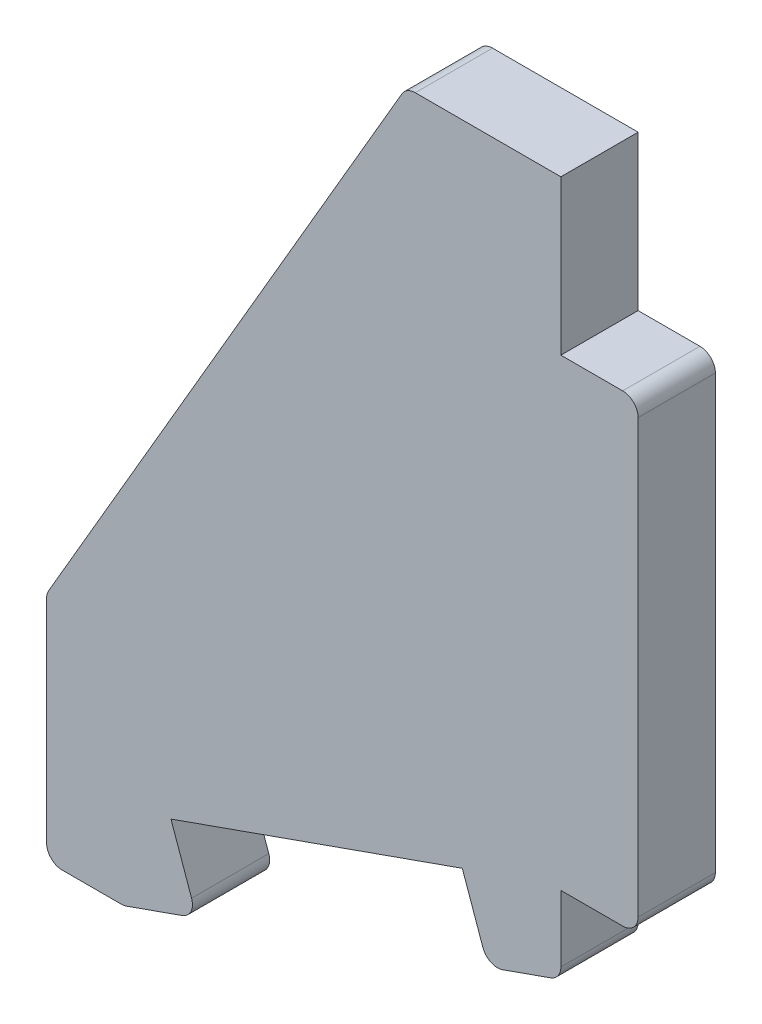
ISO-10303-21;
HEADER;
FILE_DESCRIPTION(('STEP AP214'),'2;1');
FILE_NAME('part.step','',(''),(''),'','','');
FILE_SCHEMA(('AUTOMOTIVE_DESIGN { 1 0 10303 214 1 1 1 1 }'));
ENDSEC;
DATA;
#1=APPLICATION_CONTEXT('core data for automotive mechanical design processes');
#2=APPLICATION_PROTOCOL_DEFINITION('international standard','automotive_design',2000,#1);
#3=PRODUCT_CONTEXT('',#1,'mechanical');
#4=PRODUCT('Part','Part','',(#3));
#5=PRODUCT_RELATED_PRODUCT_CATEGORY('part','',(#4));
#6=PRODUCT_DEFINITION_FORMATION('','',#4);
#7=PRODUCT_DEFINITION_CONTEXT('part definition',#1,'design');
#8=PRODUCT_DEFINITION('design','',#6,#7);
#9=PRODUCT_DEFINITION_SHAPE('','',#8);
#10=(LENGTH_UNIT() NAMED_UNIT(*) SI_UNIT(.MILLI.,.METRE.));
#11=(NAMED_UNIT(*) PLANE_ANGLE_UNIT() SI_UNIT($,.RADIAN.));
#12=(NAMED_UNIT(*) SI_UNIT($,.STERADIAN.) SOLID_ANGLE_UNIT());
#13=UNCERTAINTY_MEASURE_WITH_UNIT(LENGTH_MEASURE(1.E-05),#10,'distance_accuracy_value','');
#14=(GEOMETRIC_REPRESENTATION_CONTEXT(3) GLOBAL_UNCERTAINTY_ASSIGNED_CONTEXT((#13)) GLOBAL_UNIT_ASSIGNED_CONTEXT((#10,
#11,#12)) REPRESENTATION_CONTEXT('',''));
#15=CARTESIAN_POINT('',(0.,0.,0.));
#16=DIRECTION('',(0.,0.,1.));
#17=DIRECTION('',(1.,0.,0.));
#18=AXIS2_PLACEMENT_3D('',#15,#16,#17);
#19=CARTESIAN_POINT('',(0.,0.,5.));
#20=DIRECTION('',(-0.333333333333333,0.942809041582063,0.));
#21=DIRECTION('',(-0.942809041582063,-0.333333333333333,0.));
#22=AXIS2_PLACEMENT_3D('',#19,#20,#21);
#23=PLANE('',#22);
#24=DIRECTION('',(0.942809041582063,0.333333333333333,0.));
#25=VECTOR('',#24,1.);
#26=CARTESIAN_POINT('',(0.,0.,0.));
#27=LINE('',#26,#25);
#28=CARTESIAN_POINT('',(0.161760458079523,0.0571909584179365,0.));
#29=VERTEX_POINT('',#28);
#30=CARTESIAN_POINT('',(3.77123616632825,1.33333333333333,0.));
#31=VERTEX_POINT('',#30);
#32=EDGE_CURVE('E249',#29,#31,#27,.T.);
#33=ORIENTED_EDGE('',*,*,#32,.T.);
#34=DIRECTION('',(0.,0.,-1.));
#35=VECTOR('',#34,1.);
#36=CARTESIAN_POINT('',(3.77123616632825,1.33333333333333,5.));
#37=LINE('',#36,#35);
#38=CARTESIAN_POINT('',(3.77123616632825,1.33333333333333,5.));
#39=VERTEX_POINT('',#38);
#40=EDGE_CURVE('E351',#31,#39,#37,.F.);
#41=ORIENTED_EDGE('',*,*,#40,.T.);
#42=DIRECTION('',(0.942809041582063,0.333333333333333,0.));
#43=VECTOR('',#42,1.);
#44=CARTESIAN_POINT('',(0.,0.,5.));
#45=LINE('',#44,#43);
#46=CARTESIAN_POINT('',(0.161760458079523,0.0571909584179365,5.));
#47=VERTEX_POINT('',#46);
#48=EDGE_CURVE('E204',#47,#39,#45,.T.);
#49=ORIENTED_EDGE('',*,*,#48,.F.);
#50=DIRECTION('',(0.,0.,-1.));
#51=VECTOR('',#50,1.);
#52=CARTESIAN_POINT('',(0.161760458079523,0.0571909584179365,5.));
#53=LINE('',#52,#51);
#54=EDGE_CURVE('E348',#47,#29,#53,.T.);
#55=ORIENTED_EDGE('',*,*,#54,.T.);
#56=EDGE_LOOP('',(#33,#41,#49,#55));
#57=FACE_BOUND('',#56,.T.);
#58=ADVANCED_FACE('F36',(#57),#23,.F.);
#59=CARTESIAN_POINT('',(4.71404520791032,1.66666666666667,5.));
#60=DIRECTION('',(-0.942809041582063,-0.333333333333333,0.));
#61=DIRECTION('',(0.333333333333333,-0.942809041582063,0.));
#62=AXIS2_PLACEMENT_3D('',#59,#60,#61);
#63=PLANE('',#62);
#64=DIRECTION('',(-0.333333333333333,0.942809041582063,0.));
#65=VECTOR('',#64,1.);
#66=CARTESIAN_POINT('',(4.71404520791032,1.66666666666667,5.));
#67=LINE('',#66,#65);
#68=CARTESIAN_POINT('',(4.38071187457698,2.60947570824873,5.));
#69=VERTEX_POINT('',#68);
#70=CARTESIAN_POINT('',(3.04737854124365,6.38071187457699,5.));
#71=VERTEX_POINT('',#70);
#72=EDGE_CURVE('E190',#69,#71,#67,.T.);
#73=ORIENTED_EDGE('',*,*,#72,.F.);
#74=DIRECTION('',(0.,0.,-1.));
#75=VECTOR('',#74,1.);
#76=CARTESIAN_POINT('',(4.38071187457698,2.60947570824873,5.));
#77=LINE('',#76,#75);
#78=CARTESIAN_POINT('',(4.38071187457698,2.60947570824873,0.));
#79=VERTEX_POINT('',#78);
#80=EDGE_CURVE('E346',#69,#79,#77,.T.);
#81=ORIENTED_EDGE('',*,*,#80,.T.);
#82=DIRECTION('',(-0.333333333333333,0.942809041582063,0.));
#83=VECTOR('',#82,1.);
#84=CARTESIAN_POINT('',(4.71404520791032,1.66666666666667,0.));
#85=LINE('',#84,#83);
#86=CARTESIAN_POINT('',(3.04737854124365,6.38071187457699,0.));
#87=VERTEX_POINT('',#86);
#88=EDGE_CURVE('E210',#79,#87,#85,.T.);
#89=ORIENTED_EDGE('',*,*,#88,.T.);
#90=DIRECTION('',(0.,0.,-1.));
#91=VECTOR('',#90,1.);
#92=CARTESIAN_POINT('',(3.04737854124365,6.38071187457699,5.));
#93=LINE('',#92,#91);
#94=EDGE_CURVE('E207',#71,#87,#93,.T.);
#95=ORIENTED_EDGE('',*,*,#94,.F.);
#96=EDGE_LOOP('',(#73,#81,#89,#95));
#97=FACE_BOUND('',#96,.T.);
#98=ADVANCED_FACE('F208',(#97),#63,.F.);
#99=CARTESIAN_POINT('',(21.9035593728849,13.0473785412437,5.));
#100=DIRECTION('',(-0.333333333333333,0.942809041582063,0.));
#101=DIRECTION('',(-0.942809041582063,-0.333333333333333,0.));
#102=AXIS2_PLACEMENT_3D('',#99,#100,#101);
#103=PLANE('',#102);
#104=DIRECTION('',(0.942809041582063,0.333333333333333,0.));
#105=VECTOR('',#104,1.);
#106=CARTESIAN_POINT('',(21.9035593728849,13.0473785412437,0.));
#107=LINE('',#106,#105);
#108=CARTESIAN_POINT('',(21.9035593728849,13.0473785412437,0.));
#109=VERTEX_POINT('',#108);
#110=EDGE_CURVE('E253',#87,#109,#107,.T.);
#111=ORIENTED_EDGE('',*,*,#110,.T.);
#112=DIRECTION('',(0.,0.,-1.));
#113=VECTOR('',#112,1.);
#114=CARTESIAN_POINT('',(21.9035593728849,13.0473785412437,5.));
#115=LINE('',#114,#113);
#116=CARTESIAN_POINT('',(21.9035593728849,13.0473785412437,5.));
#117=VERTEX_POINT('',#116);
#118=EDGE_CURVE('E214',#117,#109,#115,.T.);
#119=ORIENTED_EDGE('',*,*,#118,.F.);
#120=DIRECTION('',(0.942809041582063,0.333333333333333,0.));
#121=VECTOR('',#120,1.);
#122=CARTESIAN_POINT('',(21.9035593728849,13.0473785412437,5.));
#123=LINE('',#122,#121);
#124=EDGE_CURVE('E196',#71,#117,#123,.T.);
#125=ORIENTED_EDGE('',*,*,#124,.F.);
#126=ORIENTED_EDGE('',*,*,#94,.T.);
#127=EDGE_LOOP('',(#111,#119,#125,#126));
#128=FACE_BOUND('',#127,.T.);
#129=ADVANCED_FACE('F216',(#128),#103,.F.);
#130=CARTESIAN_POINT('',(23.5702260395516,8.33333333333334,5.));
#131=DIRECTION('',(0.942809041582063,0.333333333333334,0.));
#132=DIRECTION('',(-0.333333333333334,0.942809041582063,0.));
#133=AXIS2_PLACEMENT_3D('',#130,#131,#132);
#134=PLANE('',#133);
#135=DIRECTION('',(0.333333333333334,-0.942809041582063,0.));
#136=VECTOR('',#135,1.);
#137=CARTESIAN_POINT('',(23.5702260395516,8.33333333333334,0.));
#138=LINE('',#137,#136);
#139=CARTESIAN_POINT('',(23.2368927062183,9.2761423749154,0.));
#140=VERTEX_POINT('',#139);
#141=EDGE_CURVE('E255',#109,#140,#138,.T.);
#142=ORIENTED_EDGE('',*,*,#141,.T.);
#143=DIRECTION('',(0.,0.,-1.));
#144=VECTOR('',#143,1.);
#145=CARTESIAN_POINT('',(23.2368927062183,9.2761423749154,5.));
#146=LINE('',#145,#144);
#147=CARTESIAN_POINT('',(23.2368927062183,9.2761423749154,5.));
#148=VERTEX_POINT('',#147);
#149=EDGE_CURVE('E344',#140,#148,#146,.F.);
#150=ORIENTED_EDGE('',*,*,#149,.T.);
#151=DIRECTION('',(0.333333333333334,-0.942809041582063,0.));
#152=VECTOR('',#151,1.);
#153=CARTESIAN_POINT('',(23.5702260395516,8.33333333333334,5.));
#154=LINE('',#153,#152);
#155=EDGE_CURVE('E219',#117,#148,#154,.T.);
#156=ORIENTED_EDGE('',*,*,#155,.F.);
#157=ORIENTED_EDGE('',*,*,#118,.T.);
#158=EDGE_LOOP('',(#142,#150,#156,#157));
#159=FACE_BOUND('',#158,.T.);
#160=ADVANCED_FACE('F599',(#159),#134,.F.);
#161=CARTESIAN_POINT('',(28.2842712474619,10.,5.));
#162=DIRECTION('',(-0.333333333333333,0.942809041582064,0.));
#163=DIRECTION('',(-0.942809041582064,-0.333333333333333,0.));
#164=AXIS2_PLACEMENT_3D('',#161,#162,#163);
#165=PLANE('',#164);
#166=DIRECTION('',(0.942809041582064,0.333333333333333,0.));
#167=VECTOR('',#166,1.);
#168=CARTESIAN_POINT('',(28.2842712474619,10.,0.));
#169=LINE('',#168,#167);
#170=CARTESIAN_POINT('',(24.5130350811337,8.66666666666667,0.));
#171=VERTEX_POINT('',#170);
#172=CARTESIAN_POINT('',(27.6176045807952,9.76429773960449,0.));
#173=VERTEX_POINT('',#172);
#174=EDGE_CURVE('E258',#171,#173,#169,.T.);
#175=ORIENTED_EDGE('',*,*,#174,.T.);
#176=DIRECTION('',(0.,0.,-1.));
#177=VECTOR('',#176,1.);
#178=CARTESIAN_POINT('',(27.6176045807952,9.76429773960449,5.));
#179=LINE('',#178,#177);
#180=CARTESIAN_POINT('',(27.6176045807952,9.76429773960449,5.));
#181=VERTEX_POINT('',#180);
#182=EDGE_CURVE('E342',#173,#181,#179,.F.);
#183=ORIENTED_EDGE('',*,*,#182,.T.);
#184=DIRECTION('',(0.942809041582064,0.333333333333333,0.));
#185=VECTOR('',#184,1.);
#186=CARTESIAN_POINT('',(28.2842712474619,10.,5.));
#187=LINE('',#186,#185);
#188=CARTESIAN_POINT('',(24.5130350811337,8.66666666666667,5.));
#189=VERTEX_POINT('',#188);
#190=EDGE_CURVE('E221',#189,#181,#187,.T.);
#191=ORIENTED_EDGE('',*,*,#190,.F.);
#192=DIRECTION('',(0.,0.,-1.));
#193=VECTOR('',#192,1.);
#194=CARTESIAN_POINT('',(24.5130350811337,8.66666666666667,5.));
#195=LINE('',#194,#193);
#196=EDGE_CURVE('E339',#189,#171,#195,.T.);
#197=ORIENTED_EDGE('',*,*,#196,.T.);
#198=EDGE_LOOP('',(#175,#183,#191,#197));
#199=FACE_BOUND('',#198,.T.);
#200=ADVANCED_FACE('F590',(#199),#165,.F.);
#201=CARTESIAN_POINT('',(28.2842712474619,10.,5.));
#202=DIRECTION('',(-1.,0.,0.));
#203=DIRECTION('',(0.,-1.,0.));
#204=AXIS2_PLACEMENT_3D('',#201,#202,#203);
#205=PLANE('',#204);
#206=DIRECTION('',(0.,1.,0.));
#207=VECTOR('',#206,1.);
#208=CARTESIAN_POINT('',(28.2842712474619,10.,5.));
#209=LINE('',#208,#207);
#210=CARTESIAN_POINT('',(28.2842712474619,10.7071067811866,5.));
#211=VERTEX_POINT('',#210);
#212=CARTESIAN_POINT('',(28.2842712474619,15.,5.));
#213=VERTEX_POINT('',#212);
#214=EDGE_CURVE('E227',#211,#213,#209,.T.);
#215=ORIENTED_EDGE('',*,*,#214,.F.);
#216=DIRECTION('',(0.,0.,-1.));
#217=VECTOR('',#216,1.);
#218=CARTESIAN_POINT('',(28.2842712474619,10.7071067811866,5.));
#219=LINE('',#218,#217);
#220=CARTESIAN_POINT('',(28.2842712474619,10.7071067811866,0.));
#221=VERTEX_POINT('',#220);
#222=EDGE_CURVE('E336',#211,#221,#219,.T.);
#223=ORIENTED_EDGE('',*,*,#222,.T.);
#224=DIRECTION('',(0.,1.,0.));
#225=VECTOR('',#224,1.);
#226=CARTESIAN_POINT('',(28.2842712474619,10.,0.));
#227=LINE('',#226,#225);
#228=CARTESIAN_POINT('',(28.2842712474619,15.,0.));
#229=VERTEX_POINT('',#228);
#230=EDGE_CURVE('E261',#221,#229,#227,.T.);
#231=ORIENTED_EDGE('',*,*,#230,.T.);
#232=DIRECTION('',(0.,0.,-1.));
#233=VECTOR('',#232,1.);
#234=CARTESIAN_POINT('',(28.2842712474619,15.,5.));
#235=LINE('',#234,#233);
#236=EDGE_CURVE('E289',#213,#229,#235,.T.);
#237=ORIENTED_EDGE('',*,*,#236,.F.);
#238=EDGE_LOOP('',(#215,#223,#231,#237));
#239=FACE_BOUND('',#238,.T.);
#240=ADVANCED_FACE('F436',(#239),#205,.F.);
#241=CARTESIAN_POINT('',(28.2842712474619,15.,5.));
#242=DIRECTION('',(0.,1.,0.));
#243=DIRECTION('',(-1.,0.,0.));
#244=AXIS2_PLACEMENT_3D('',#241,#242,#243);
#245=PLANE('',#244);
#246=DIRECTION('',(1.,0.,0.));
#247=VECTOR('',#246,1.);
#248=CARTESIAN_POINT('',(28.2842712474619,15.,0.));
#249=LINE('',#248,#247);
#250=CARTESIAN_POINT('',(32.2842712474619,15.,0.));
#251=VERTEX_POINT('',#250);
#252=EDGE_CURVE('E263',#229,#251,#249,.T.);
#253=ORIENTED_EDGE('',*,*,#252,.T.);
#254=DIRECTION('',(0.,0.,-1.));
#255=VECTOR('',#254,1.);
#256=CARTESIAN_POINT('',(32.2842712474619,15.,5.));
#257=LINE('',#256,#255);
#258=CARTESIAN_POINT('',(32.2842712474619,15.,5.));
#259=VERTEX_POINT('',#258);
#260=EDGE_CURVE('E334',#251,#259,#257,.F.);
#261=ORIENTED_EDGE('',*,*,#260,.T.);
#262=DIRECTION('',(1.,0.,0.));
#263=VECTOR('',#262,1.);
#264=CARTESIAN_POINT('',(28.2842712474619,15.,5.));
#265=LINE('',#264,#263);
#266=EDGE_CURVE('E229',#213,#259,#265,.T.);
#267=ORIENTED_EDGE('',*,*,#266,.F.);
#268=ORIENTED_EDGE('',*,*,#236,.T.);
#269=EDGE_LOOP('',(#253,#261,#267,#268));
#270=FACE_BOUND('',#269,.T.);
#271=ADVANCED_FACE('F441',(#270),#245,.F.);
#272=CARTESIAN_POINT('',(33.2842712474619,15.,5.));
#273=DIRECTION('',(-1.,0.,0.));
#274=DIRECTION('',(0.,0.,1.));
#275=AXIS2_PLACEMENT_3D('',#272,#273,#274);
#276=PLANE('',#275);
#277=DIRECTION('',(0.,1.,0.));
#278=VECTOR('',#277,1.);
#279=CARTESIAN_POINT('',(33.2842712474619,15.,0.));
#280=LINE('',#279,#278);
#281=CARTESIAN_POINT('',(33.2842712474619,16.,0.));
#282=VERTEX_POINT('',#281);
#283=CARTESIAN_POINT('',(33.2842712474619,44.,0.));
#284=VERTEX_POINT('',#283);
#285=EDGE_CURVE('E266',#282,#284,#280,.T.);
#286=ORIENTED_EDGE('',*,*,#285,.T.);
#287=DIRECTION('',(0.,0.,-1.));
#288=VECTOR('',#287,1.);
#289=CARTESIAN_POINT('',(33.2842712474619,44.,5.));
#290=LINE('',#289,#288);
#291=CARTESIAN_POINT('',(33.2842712474619,44.,5.));
#292=VERTEX_POINT('',#291);
#293=EDGE_CURVE('E316',#284,#292,#290,.F.);
#294=ORIENTED_EDGE('',*,*,#293,.T.);
#295=DIRECTION('',(0.,1.,0.));
#296=VECTOR('',#295,1.);
#297=CARTESIAN_POINT('',(33.2842712474619,15.,5.));
#298=LINE('',#297,#296);
#299=CARTESIAN_POINT('',(33.2842712474619,16.,5.));
#300=VERTEX_POINT('',#299);
#301=EDGE_CURVE('E232',#300,#292,#298,.T.);
#302=ORIENTED_EDGE('',*,*,#301,.F.);
#303=DIRECTION('',(0.,0.,-1.));
#304=VECTOR('',#303,1.);
#305=CARTESIAN_POINT('',(33.2842712474619,16.,5.));
#306=LINE('',#305,#304);
#307=EDGE_CURVE('E313',#300,#282,#306,.T.);
#308=ORIENTED_EDGE('',*,*,#307,.T.);
#309=EDGE_LOOP('',(#286,#294,#302,#308));
#310=FACE_BOUND('',#309,.T.);
#311=ADVANCED_FACE('F448',(#310),#276,.F.);
#312=CARTESIAN_POINT('',(33.2842712474619,45.,5.));
#313=DIRECTION('',(0.,-1.,0.));
#314=DIRECTION('',(0.,0.,-1.));
#315=AXIS2_PLACEMENT_3D('',#312,#313,#314);
#316=PLANE('',#315);
#317=DIRECTION('',(-1.,0.,0.));
#318=VECTOR('',#317,1.);
#319=CARTESIAN_POINT('',(33.2842712474619,45.,5.));
#320=LINE('',#319,#318);
#321=CARTESIAN_POINT('',(32.2842712474619,45.,5.));
#322=VERTEX_POINT('',#321);
#323=CARTESIAN_POINT('',(28.2842712474619,45.,5.));
#324=VERTEX_POINT('',#323);
#325=EDGE_CURVE('E234',#322,#324,#320,.T.);
#326=ORIENTED_EDGE('',*,*,#325,.F.);
#327=DIRECTION('',(0.,0.,-1.));
#328=VECTOR('',#327,1.);
#329=CARTESIAN_POINT('',(32.2842712474619,45.,5.));
#330=LINE('',#329,#328);
#331=CARTESIAN_POINT('',(32.2842712474619,45.,0.));
#332=VERTEX_POINT('',#331);
#333=EDGE_CURVE('E213',#322,#332,#330,.T.);
#334=ORIENTED_EDGE('',*,*,#333,.T.);
#335=DIRECTION('',(-1.,0.,0.));
#336=VECTOR('',#335,1.);
#337=CARTESIAN_POINT('',(33.2842712474619,45.,0.));
#338=LINE('',#337,#336);
#339=CARTESIAN_POINT('',(28.2842712474619,45.,0.));
#340=VERTEX_POINT('',#339);
#341=EDGE_CURVE('E269',#332,#340,#338,.T.);
#342=ORIENTED_EDGE('',*,*,#341,.T.);
#343=DIRECTION('',(0.,0.,-1.));
#344=VECTOR('',#343,1.);
#345=CARTESIAN_POINT('',(28.2842712474619,45.,5.));
#346=LINE('',#345,#344);
#347=EDGE_CURVE('E286',#324,#340,#346,.T.);
#348=ORIENTED_EDGE('',*,*,#347,.F.);
#349=EDGE_LOOP('',(#326,#334,#342,#348));
#350=FACE_BOUND('',#349,.T.);
#351=ADVANCED_FACE('F455',(#350),#316,.F.);
#352=CARTESIAN_POINT('',(28.2842712474619,45.,5.));
#353=DIRECTION('',(-1.,0.,0.));
#354=DIRECTION('',(0.,0.,1.));
#355=AXIS2_PLACEMENT_3D('',#352,#353,#354);
#356=PLANE('',#355);
#357=DIRECTION('',(0.,1.,0.));
#358=VECTOR('',#357,1.);
#359=CARTESIAN_POINT('',(28.2842712474619,45.,0.));
#360=LINE('',#359,#358);
#361=CARTESIAN_POINT('',(28.2842712474619,55.,0.));
#362=VERTEX_POINT('',#361);
#363=EDGE_CURVE('E271',#340,#362,#360,.T.);
#364=ORIENTED_EDGE('',*,*,#363,.T.);
#365=DIRECTION('',(0.,0.,-1.));
#366=VECTOR('',#365,1.);
#367=CARTESIAN_POINT('',(28.2842712474619,55.,5.));
#368=LINE('',#367,#366);
#369=CARTESIAN_POINT('',(28.2842712474619,55.,5.));
#370=VERTEX_POINT('',#369);
#371=EDGE_CURVE('E248',#370,#362,#368,.T.);
#372=ORIENTED_EDGE('',*,*,#371,.F.);
#373=DIRECTION('',(0.,1.,0.));
#374=VECTOR('',#373,1.);
#375=CARTESIAN_POINT('',(28.2842712474619,45.,5.));
#376=LINE('',#375,#374);
#377=EDGE_CURVE('E236',#324,#370,#376,.T.);
#378=ORIENTED_EDGE('',*,*,#377,.F.);
#379=ORIENTED_EDGE('',*,*,#347,.T.);
#380=EDGE_LOOP('',(#364,#372,#378,#379));
#381=FACE_BOUND('',#380,.T.);
#382=ADVANCED_FACE('F461',(#381),#356,.F.);
#383=CARTESIAN_POINT('',(18.2842712474619,55.,5.));
#384=DIRECTION('',(0.,-1.,0.));
#385=DIRECTION('',(0.,0.,-1.));
#386=AXIS2_PLACEMENT_3D('',#383,#384,#385);
#387=PLANE('',#386);
#388=DIRECTION('',(-1.,0.,0.));
#389=VECTOR('',#388,1.);
#390=CARTESIAN_POINT('',(18.2842712474619,55.,0.));
#391=LINE('',#390,#389);
#392=CARTESIAN_POINT('',(18.8592505930193,55.,0.));
#393=VERTEX_POINT('',#392);
#394=EDGE_CURVE('E273',#362,#393,#391,.T.);
#395=ORIENTED_EDGE('',*,*,#394,.T.);
#396=DIRECTION('',(0.,0.,-1.));
#397=VECTOR('',#396,1.);
#398=CARTESIAN_POINT('',(18.8592505930193,55.,5.));
#399=LINE('',#398,#397);
#400=CARTESIAN_POINT('',(18.8592505930193,55.,5.));
#401=VERTEX_POINT('',#400);
#402=EDGE_CURVE('E11',#393,#401,#399,.F.);
#403=ORIENTED_EDGE('',*,*,#402,.T.);
#404=DIRECTION('',(-1.,0.,0.));
#405=VECTOR('',#404,1.);
#406=CARTESIAN_POINT('',(18.2842712474619,55.,5.));
#407=LINE('',#406,#405);
#408=EDGE_CURVE('E238',#370,#401,#407,.T.);
#409=ORIENTED_EDGE('',*,*,#408,.F.);
#410=ORIENTED_EDGE('',*,*,#371,.T.);
#411=EDGE_LOOP('',(#395,#403,#409,#410));
#412=FACE_BOUND('',#411,.T.);
#413=ADVANCED_FACE('F464',(#412),#387,.F.);
#414=CARTESIAN_POINT('',(-5.,15.,5.));
#415=DIRECTION('',(0.8642399013235,-0.503079907132402,0.));
#416=DIRECTION('',(0.503079907132402,0.8642399013235,0.));
#417=AXIS2_PLACEMENT_3D('',#414,#415,#416);
#418=PLANE('',#417);
#419=DIRECTION('',(-0.503079907132402,-0.8642399013235,0.));
#420=VECTOR('',#419,1.);
#421=CARTESIAN_POINT('',(-5.,15.,0.));
#422=LINE('',#421,#420);
#423=CARTESIAN_POINT('',(17.9950106916958,54.5030799071324,0.));
#424=VERTEX_POINT('',#423);
#425=CARTESIAN_POINT('',(-4.8642399013235,15.233221984461,0.));
#426=VERTEX_POINT('',#425);
#427=EDGE_CURVE('E276',#424,#426,#422,.T.);
#428=ORIENTED_EDGE('',*,*,#427,.T.);
#429=DIRECTION('',(0.,0.,-1.));
#430=VECTOR('',#429,1.);
#431=CARTESIAN_POINT('',(-4.8642399013235,15.233221984461,5.));
#432=LINE('',#431,#430);
#433=CARTESIAN_POINT('',(-4.8642399013235,15.233221984461,5.));
#434=VERTEX_POINT('',#433);
#435=EDGE_CURVE('E44',#426,#434,#432,.F.);
#436=ORIENTED_EDGE('',*,*,#435,.T.);
#437=DIRECTION('',(-0.503079907132402,-0.8642399013235,0.));
#438=VECTOR('',#437,1.);
#439=CARTESIAN_POINT('',(-5.,15.,5.));
#440=LINE('',#439,#438);
#441=CARTESIAN_POINT('',(17.9950106916958,54.5030799071324,5.));
#442=VERTEX_POINT('',#441);
#443=EDGE_CURVE('E241',#442,#434,#440,.T.);
#444=ORIENTED_EDGE('',*,*,#443,.F.);
#445=DIRECTION('',(0.,0.,-1.));
#446=VECTOR('',#445,1.);
#447=CARTESIAN_POINT('',(17.9950106916958,54.5030799071324,5.));
#448=LINE('',#447,#446);
#449=EDGE_CURVE('E362',#442,#424,#448,.T.);
#450=ORIENTED_EDGE('',*,*,#449,.T.);
#451=EDGE_LOOP('',(#428,#436,#444,#450));
#452=FACE_BOUND('',#451,.T.);
#453=ADVANCED_FACE('F367',(#452),#418,.F.);
#454=CARTESIAN_POINT('',(-5.,0.,5.));
#455=DIRECTION('',(1.,0.,0.));
#456=DIRECTION('',(0.,0.,-1.));
#457=AXIS2_PLACEMENT_3D('',#454,#455,#456);
#458=PLANE('',#457);
#459=DIRECTION('',(0.,-1.,0.));
#460=VECTOR('',#459,1.);
#461=CARTESIAN_POINT('',(-5.,0.,0.));
#462=LINE('',#461,#460);
#463=CARTESIAN_POINT('',(-5.,14.7301420773285,0.));
#464=VERTEX_POINT('',#463);
#465=CARTESIAN_POINT('',(-5.,1.,0.));
#466=VERTEX_POINT('',#465);
#467=EDGE_CURVE('E279',#464,#466,#462,.T.);
#468=ORIENTED_EDGE('',*,*,#467,.T.);
#469=DIRECTION('',(0.,0.,-1.));
#470=VECTOR('',#469,1.);
#471=CARTESIAN_POINT('',(-5.,1.,5.));
#472=LINE('',#471,#470);
#473=CARTESIAN_POINT('',(-5.,1.,5.));
#474=VERTEX_POINT('',#473);
#475=EDGE_CURVE('E360',#466,#474,#472,.F.);
#476=ORIENTED_EDGE('',*,*,#475,.T.);
#477=DIRECTION('',(0.,-1.,0.));
#478=VECTOR('',#477,1.);
#479=CARTESIAN_POINT('',(-5.,0.,5.));
#480=LINE('',#479,#478);
#481=CARTESIAN_POINT('',(-5.,14.7301420773285,5.));
#482=VERTEX_POINT('',#481);
#483=EDGE_CURVE('E244',#482,#474,#480,.T.);
#484=ORIENTED_EDGE('',*,*,#483,.F.);
#485=DIRECTION('',(0.,0.,-1.));
#486=VECTOR('',#485,1.);
#487=CARTESIAN_POINT('',(-5.,14.7301420773285,5.));
#488=LINE('',#487,#486);
#489=EDGE_CURVE('E357',#482,#464,#488,.T.);
#490=ORIENTED_EDGE('',*,*,#489,.T.);
#491=EDGE_LOOP('',(#468,#476,#484,#490));
#492=FACE_BOUND('',#491,.T.);
#493=ADVANCED_FACE('F378',(#492),#458,.F.);
#494=CARTESIAN_POINT('',(0.,0.,5.));
#495=DIRECTION('',(0.,1.,0.));
#496=DIRECTION('',(-1.,0.,0.));
#497=AXIS2_PLACEMENT_3D('',#494,#495,#496);
#498=PLANE('',#497);
#499=DIRECTION('',(1.,0.,0.));
#500=VECTOR('',#499,1.);
#501=CARTESIAN_POINT('',(0.,0.,0.));
#502=LINE('',#501,#500);
#503=CARTESIAN_POINT('',(-4.,0.,0.));
#504=VERTEX_POINT('',#503);
#505=CARTESIAN_POINT('',(-0.17157287525381,0.,0.));
#506=VERTEX_POINT('',#505);
#507=EDGE_CURVE('E282',#504,#506,#502,.T.);
#508=ORIENTED_EDGE('',*,*,#507,.T.);
#509=DIRECTION('',(0.,0.,-1.));
#510=VECTOR('',#509,1.);
#511=CARTESIAN_POINT('',(-0.17157287525381,0.,5.));
#512=LINE('',#511,#510);
#513=CARTESIAN_POINT('',(-0.17157287525381,0.,5.));
#514=VERTEX_POINT('',#513);
#515=EDGE_CURVE('E51',#506,#514,#512,.F.);
#516=ORIENTED_EDGE('',*,*,#515,.T.);
#517=DIRECTION('',(1.,0.,0.));
#518=VECTOR('',#517,1.);
#519=CARTESIAN_POINT('',(0.,0.,5.));
#520=LINE('',#519,#518);
#521=CARTESIAN_POINT('',(-4.,0.,5.));
#522=VERTEX_POINT('',#521);
#523=EDGE_CURVE('E246',#522,#514,#520,.T.);
#524=ORIENTED_EDGE('',*,*,#523,.F.);
#525=DIRECTION('',(0.,0.,-1.));
#526=VECTOR('',#525,1.);
#527=CARTESIAN_POINT('',(-4.,0.,5.));
#528=LINE('',#527,#526);
#529=EDGE_CURVE('E353',#522,#504,#528,.T.);
#530=ORIENTED_EDGE('',*,*,#529,.T.);
#531=EDGE_LOOP('',(#508,#516,#524,#530));
#532=FACE_BOUND('',#531,.T.);
#533=ADVANCED_FACE('F387',(#532),#498,.F.);
#534=CARTESIAN_POINT('',(0.,0.,5.));
#535=DIRECTION('',(0.,0.,1.));
#536=DIRECTION('',(1.,0.,0.));
#537=AXIS2_PLACEMENT_3D('',#534,#535,#536);
#538=PLANE('',#537);
#539=ORIENTED_EDGE('',*,*,#301,.T.);
#540=CARTESIAN_POINT('',(32.2842712474619,44.,5.));
#541=DIRECTION('',(0.,0.,1.));
#542=DIRECTION('',(1.,0.,0.));
#543=AXIS2_PLACEMENT_3D('',#540,#541,#542);
#544=CIRCLE('',#543,1.);
#545=EDGE_CURVE('E332',#292,#322,#544,.T.);
#546=ORIENTED_EDGE('',*,*,#545,.T.);
#547=ORIENTED_EDGE('',*,*,#325,.T.);
#548=ORIENTED_EDGE('',*,*,#377,.T.);
#549=ORIENTED_EDGE('',*,*,#408,.T.);
#550=CARTESIAN_POINT('',(18.8592505930193,54.,5.));
#551=DIRECTION('',(0.,0.,1.));
#552=DIRECTION('',(1.,0.,0.));
#553=AXIS2_PLACEMENT_3D('',#550,#551,#552);
#554=CIRCLE('',#553,1.);
#555=EDGE_CURVE('E318',#401,#442,#554,.T.);
#556=ORIENTED_EDGE('',*,*,#555,.T.);
#557=ORIENTED_EDGE('',*,*,#443,.T.);
#558=CARTESIAN_POINT('',(-4.,14.7301420773285,5.));
#559=DIRECTION('',(0.,0.,1.));
#560=DIRECTION('',(1.,0.,0.));
#561=AXIS2_PLACEMENT_3D('',#558,#559,#560);
#562=CIRCLE('',#561,1.);
#563=EDGE_CURVE('E320',#434,#482,#562,.T.);
#564=ORIENTED_EDGE('',*,*,#563,.T.);
#565=ORIENTED_EDGE('',*,*,#483,.T.);
#566=CARTESIAN_POINT('',(-4.,1.,5.));
#567=DIRECTION('',(0.,0.,1.));
#568=DIRECTION('',(1.,0.,0.));
#569=AXIS2_PLACEMENT_3D('',#566,#567,#568);
#570=CIRCLE('',#569,1.);
#571=EDGE_CURVE('E58',#474,#522,#570,.T.);
#572=ORIENTED_EDGE('',*,*,#571,.T.);
#573=ORIENTED_EDGE('',*,*,#523,.T.);
#574=CARTESIAN_POINT('',(-0.17157287525381,1.,5.));
#575=DIRECTION('',(0.,0.,1.));
#576=DIRECTION('',(1.,0.,0.));
#577=AXIS2_PLACEMENT_3D('',#574,#575,#576);
#578=CIRCLE('',#577,1.);
#579=EDGE_CURVE('E323',#514,#47,#578,.T.);
#580=ORIENTED_EDGE('',*,*,#579,.T.);
#581=ORIENTED_EDGE('',*,*,#48,.T.);
#582=CARTESIAN_POINT('',(3.43790283299492,2.2761423749154,5.));
#583=DIRECTION('',(0.,0.,1.));
#584=DIRECTION('',(1.,0.,0.));
#585=AXIS2_PLACEMENT_3D('',#582,#583,#584);
#586=CIRCLE('',#585,1.);
#587=EDGE_CURVE('E200',#39,#69,#586,.T.);
#588=ORIENTED_EDGE('',*,*,#587,.T.);
#589=ORIENTED_EDGE('',*,*,#72,.T.);
#590=ORIENTED_EDGE('',*,*,#124,.T.);
#591=ORIENTED_EDGE('',*,*,#155,.T.);
#592=CARTESIAN_POINT('',(24.1797017478003,9.60947570824874,5.));
#593=DIRECTION('',(0.,0.,1.));
#594=DIRECTION('',(1.,0.,0.));
#595=AXIS2_PLACEMENT_3D('',#592,#593,#594);
#596=CIRCLE('',#595,1.);
#597=EDGE_CURVE('E326',#148,#189,#596,.T.);
#598=ORIENTED_EDGE('',*,*,#597,.T.);
#599=ORIENTED_EDGE('',*,*,#190,.T.);
#600=CARTESIAN_POINT('',(27.2842712474619,10.7071067811866,5.));
#601=DIRECTION('',(0.,0.,1.));
#602=DIRECTION('',(1.,0.,0.));
#603=AXIS2_PLACEMENT_3D('',#600,#601,#602);
#604=CIRCLE('',#603,1.);
#605=EDGE_CURVE('E328',#181,#211,#604,.T.);
#606=ORIENTED_EDGE('',*,*,#605,.T.);
#607=ORIENTED_EDGE('',*,*,#214,.T.);
#608=ORIENTED_EDGE('',*,*,#266,.T.);
#609=CARTESIAN_POINT('',(32.2842712474619,16.,5.));
#610=DIRECTION('',(0.,0.,1.));
#611=DIRECTION('',(1.,0.,0.));
#612=AXIS2_PLACEMENT_3D('',#609,#610,#611);
#613=CIRCLE('',#612,1.);
#614=EDGE_CURVE('E330',#259,#300,#613,.T.);
#615=ORIENTED_EDGE('',*,*,#614,.T.);
#616=EDGE_LOOP('',(#539,#546,#547,#548,#549,#556,#557,#564,#565,#572,#573,#580,#581,#588,#589,
#590,#591,#598,#599,#606,#607,#608,#615));
#617=FACE_BOUND('',#616,.T.);
#618=ADVANCED_FACE('F193',(#617),#538,.T.);
#619=CARTESIAN_POINT('',(0.,0.,0.));
#620=DIRECTION('',(0.,0.,1.));
#621=DIRECTION('',(1.,0.,0.));
#622=AXIS2_PLACEMENT_3D('',#619,#620,#621);
#623=PLANE('',#622);
#624=ORIENTED_EDGE('',*,*,#341,.F.);
#625=CARTESIAN_POINT('',(32.2842712474619,44.,0.));
#626=DIRECTION('',(0.,0.,1.));
#627=DIRECTION('',(1.,0.,0.));
#628=AXIS2_PLACEMENT_3D('',#625,#626,#627);
#629=CIRCLE('',#628,1.);
#630=EDGE_CURVE('E311',#332,#284,#629,.F.);
#631=ORIENTED_EDGE('',*,*,#630,.T.);
#632=ORIENTED_EDGE('',*,*,#285,.F.);
#633=CARTESIAN_POINT('',(32.2842712474619,16.,0.));
#634=DIRECTION('',(0.,0.,1.));
#635=DIRECTION('',(1.,0.,0.));
#636=AXIS2_PLACEMENT_3D('',#633,#634,#635);
#637=CIRCLE('',#636,1.);
#638=EDGE_CURVE('E309',#282,#251,#637,.F.);
#639=ORIENTED_EDGE('',*,*,#638,.T.);
#640=ORIENTED_EDGE('',*,*,#252,.F.);
#641=ORIENTED_EDGE('',*,*,#230,.F.);
#642=CARTESIAN_POINT('',(27.2842712474619,10.7071067811866,0.));
#643=DIRECTION('',(0.,0.,1.));
#644=DIRECTION('',(1.,0.,0.));
#645=AXIS2_PLACEMENT_3D('',#642,#643,#644);
#646=CIRCLE('',#645,1.);
#647=EDGE_CURVE('E307',#221,#173,#646,.F.);
#648=ORIENTED_EDGE('',*,*,#647,.T.);
#649=ORIENTED_EDGE('',*,*,#174,.F.);
#650=CARTESIAN_POINT('',(24.1797017478003,9.60947570824874,0.));
#651=DIRECTION('',(0.,0.,1.));
#652=DIRECTION('',(1.,0.,0.));
#653=AXIS2_PLACEMENT_3D('',#650,#651,#652);
#654=CIRCLE('',#653,1.);
#655=EDGE_CURVE('E305',#171,#140,#654,.F.);
#656=ORIENTED_EDGE('',*,*,#655,.T.);
#657=ORIENTED_EDGE('',*,*,#141,.F.);
#658=ORIENTED_EDGE('',*,*,#110,.F.);
#659=ORIENTED_EDGE('',*,*,#88,.F.);
#660=CARTESIAN_POINT('',(3.43790283299492,2.2761423749154,0.));
#661=DIRECTION('',(0.,0.,1.));
#662=DIRECTION('',(1.,0.,0.));
#663=AXIS2_PLACEMENT_3D('',#660,#661,#662);
#664=CIRCLE('',#663,1.);
#665=EDGE_CURVE('E303',#79,#31,#664,.F.);
#666=ORIENTED_EDGE('',*,*,#665,.T.);
#667=ORIENTED_EDGE('',*,*,#32,.F.);
#668=CARTESIAN_POINT('',(-0.17157287525381,1.,0.));
#669=DIRECTION('',(0.,0.,1.));
#670=DIRECTION('',(1.,0.,0.));
#671=AXIS2_PLACEMENT_3D('',#668,#669,#670);
#672=CIRCLE('',#671,1.);
#673=EDGE_CURVE('E301',#29,#506,#672,.F.);
#674=ORIENTED_EDGE('',*,*,#673,.T.);
#675=ORIENTED_EDGE('',*,*,#507,.F.);
#676=CARTESIAN_POINT('',(-4.,1.,0.));
#677=DIRECTION('',(0.,0.,1.));
#678=DIRECTION('',(1.,0.,0.));
#679=AXIS2_PLACEMENT_3D('',#676,#677,#678);
#680=CIRCLE('',#679,1.);
#681=EDGE_CURVE('E299',#504,#466,#680,.F.);
#682=ORIENTED_EDGE('',*,*,#681,.T.);
#683=ORIENTED_EDGE('',*,*,#467,.F.);
#684=CARTESIAN_POINT('',(-4.,14.7301420773285,0.));
#685=DIRECTION('',(0.,0.,1.));
#686=DIRECTION('',(1.,0.,0.));
#687=AXIS2_PLACEMENT_3D('',#684,#685,#686);
#688=CIRCLE('',#687,1.);
#689=EDGE_CURVE('E297',#464,#426,#688,.F.);
#690=ORIENTED_EDGE('',*,*,#689,.T.);
#691=ORIENTED_EDGE('',*,*,#427,.F.);
#692=CARTESIAN_POINT('',(18.8592505930193,54.,0.));
#693=DIRECTION('',(0.,0.,1.));
#694=DIRECTION('',(1.,0.,0.));
#695=AXIS2_PLACEMENT_3D('',#692,#693,#694);
#696=CIRCLE('',#695,1.);
#697=EDGE_CURVE('E295',#424,#393,#696,.F.);
#698=ORIENTED_EDGE('',*,*,#697,.T.);
#699=ORIENTED_EDGE('',*,*,#394,.F.);
#700=ORIENTED_EDGE('',*,*,#363,.F.);
#701=EDGE_LOOP('',(#624,#631,#632,#639,#640,#641,#648,#649,#656,#657,#658,#659,#666,#667,#674,
#675,#682,#683,#690,#691,#698,#699,#700));
#702=FACE_BOUND('',#701,.T.);
#703=ADVANCED_FACE('F382',(#702),#623,.F.);
#704=CARTESIAN_POINT('',(32.2842712474619,44.,5.));
#705=DIRECTION('',(0.,0.,-1.));
#706=DIRECTION('',(-1.,0.,0.));
#707=AXIS2_PLACEMENT_3D('',#704,#705,#706);
#708=CYLINDRICAL_SURFACE('',#707,1.);
#709=ORIENTED_EDGE('',*,*,#545,.F.);
#710=ORIENTED_EDGE('',*,*,#293,.F.);
#711=ORIENTED_EDGE('',*,*,#630,.F.);
#712=ORIENTED_EDGE('',*,*,#333,.F.);
#713=EDGE_LOOP('',(#709,#710,#711,#712));
#714=FACE_BOUND('',#713,.T.);
#715=ADVANCED_FACE('F417',(#714),#708,.T.);
#716=CARTESIAN_POINT('',(32.2842712474619,16.,5.));
#717=DIRECTION('',(0.,0.,-1.));
#718=DIRECTION('',(-1.,0.,0.));
#719=AXIS2_PLACEMENT_3D('',#716,#717,#718);
#720=CYLINDRICAL_SURFACE('',#719,1.);
#721=ORIENTED_EDGE('',*,*,#614,.F.);
#722=ORIENTED_EDGE('',*,*,#260,.F.);
#723=ORIENTED_EDGE('',*,*,#638,.F.);
#724=ORIENTED_EDGE('',*,*,#307,.F.);
#725=EDGE_LOOP('',(#721,#722,#723,#724));
#726=FACE_BOUND('',#725,.T.);
#727=ADVANCED_FACE('F420',(#726),#720,.T.);
#728=CARTESIAN_POINT('',(27.2842712474619,10.7071067811866,5.));
#729=DIRECTION('',(0.,0.,-1.));
#730=DIRECTION('',(-1.,0.,0.));
#731=AXIS2_PLACEMENT_3D('',#728,#729,#730);
#732=CYLINDRICAL_SURFACE('',#731,1.);
#733=ORIENTED_EDGE('',*,*,#605,.F.);
#734=ORIENTED_EDGE('',*,*,#182,.F.);
#735=ORIENTED_EDGE('',*,*,#647,.F.);
#736=ORIENTED_EDGE('',*,*,#222,.F.);
#737=EDGE_LOOP('',(#733,#734,#735,#736));
#738=FACE_BOUND('',#737,.T.);
#739=ADVANCED_FACE('F406',(#738),#732,.T.);
#740=CARTESIAN_POINT('',(24.1797017478003,9.60947570824874,5.));
#741=DIRECTION('',(0.,0.,-1.));
#742=DIRECTION('',(-1.,0.,0.));
#743=AXIS2_PLACEMENT_3D('',#740,#741,#742);
#744=CYLINDRICAL_SURFACE('',#743,1.);
#745=ORIENTED_EDGE('',*,*,#597,.F.);
#746=ORIENTED_EDGE('',*,*,#149,.F.);
#747=ORIENTED_EDGE('',*,*,#655,.F.);
#748=ORIENTED_EDGE('',*,*,#196,.F.);
#749=EDGE_LOOP('',(#745,#746,#747,#748));
#750=FACE_BOUND('',#749,.T.);
#751=ADVANCED_FACE('F399',(#750),#744,.T.);
#752=CARTESIAN_POINT('',(3.43790283299492,2.2761423749154,5.));
#753=DIRECTION('',(0.,0.,-1.));
#754=DIRECTION('',(-1.,0.,0.));
#755=AXIS2_PLACEMENT_3D('',#752,#753,#754);
#756=CYLINDRICAL_SURFACE('',#755,1.);
#757=ORIENTED_EDGE('',*,*,#587,.F.);
#758=ORIENTED_EDGE('',*,*,#40,.F.);
#759=ORIENTED_EDGE('',*,*,#665,.F.);
#760=ORIENTED_EDGE('',*,*,#80,.F.);
#761=EDGE_LOOP('',(#757,#758,#759,#760));
#762=FACE_BOUND('',#761,.T.);
#763=ADVANCED_FACE('F397',(#762),#756,.T.);
#764=CARTESIAN_POINT('',(-0.17157287525381,1.,5.));
#765=DIRECTION('',(0.,0.,-1.));
#766=DIRECTION('',(-1.,0.,0.));
#767=AXIS2_PLACEMENT_3D('',#764,#765,#766);
#768=CYLINDRICAL_SURFACE('',#767,1.);
#769=ORIENTED_EDGE('',*,*,#579,.F.);
#770=ORIENTED_EDGE('',*,*,#515,.F.);
#771=ORIENTED_EDGE('',*,*,#673,.F.);
#772=ORIENTED_EDGE('',*,*,#54,.F.);
#773=EDGE_LOOP('',(#769,#770,#771,#772));
#774=FACE_BOUND('',#773,.T.);
#775=ADVANCED_FACE('F392',(#774),#768,.T.);
#776=CARTESIAN_POINT('',(-4.,1.,5.));
#777=DIRECTION('',(0.,0.,-1.));
#778=DIRECTION('',(-1.,0.,0.));
#779=AXIS2_PLACEMENT_3D('',#776,#777,#778);
#780=CYLINDRICAL_SURFACE('',#779,1.);
#781=ORIENTED_EDGE('',*,*,#571,.F.);
#782=ORIENTED_EDGE('',*,*,#475,.F.);
#783=ORIENTED_EDGE('',*,*,#681,.F.);
#784=ORIENTED_EDGE('',*,*,#529,.F.);
#785=EDGE_LOOP('',(#781,#782,#783,#784));
#786=FACE_BOUND('',#785,.T.);
#787=ADVANCED_FACE('F386',(#786),#780,.T.);
#788=CARTESIAN_POINT('',(-4.,14.7301420773285,5.));
#789=DIRECTION('',(0.,0.,-1.));
#790=DIRECTION('',(-1.,0.,0.));
#791=AXIS2_PLACEMENT_3D('',#788,#789,#790);
#792=CYLINDRICAL_SURFACE('',#791,1.);
#793=ORIENTED_EDGE('',*,*,#563,.F.);
#794=ORIENTED_EDGE('',*,*,#435,.F.);
#795=ORIENTED_EDGE('',*,*,#689,.F.);
#796=ORIENTED_EDGE('',*,*,#489,.F.);
#797=EDGE_LOOP('',(#793,#794,#795,#796));
#798=FACE_BOUND('',#797,.T.);
#799=ADVANCED_FACE('F375',(#798),#792,.T.);
#800=CARTESIAN_POINT('',(18.8592505930193,54.,5.));
#801=DIRECTION('',(0.,0.,-1.));
#802=DIRECTION('',(-1.,0.,0.));
#803=AXIS2_PLACEMENT_3D('',#800,#801,#802);
#804=CYLINDRICAL_SURFACE('',#803,1.);
#805=ORIENTED_EDGE('',*,*,#555,.F.);
#806=ORIENTED_EDGE('',*,*,#402,.F.);
#807=ORIENTED_EDGE('',*,*,#697,.F.);
#808=ORIENTED_EDGE('',*,*,#449,.F.);
#809=EDGE_LOOP('',(#805,#806,#807,#808));
#810=FACE_BOUND('',#809,.T.);
#811=ADVANCED_FACE('F38',(#810),#804,.T.);
#812=CLOSED_SHELL('',(#58,#98,#129,#160,#200,#240,#271,#311,#351,#382,#413,#453,#493,#533,#618,
#703,#715,#727,#739,#751,#763,#775,#787,#799,#811));
#813=MANIFOLD_SOLID_BREP('B2',#812);
#814=ADVANCED_BREP_SHAPE_REPRESENTATION('',(#18,#813),#14);
#815=SHAPE_DEFINITION_REPRESENTATION(#9,#814);
ENDSEC;
END-ISO-10303-21;
